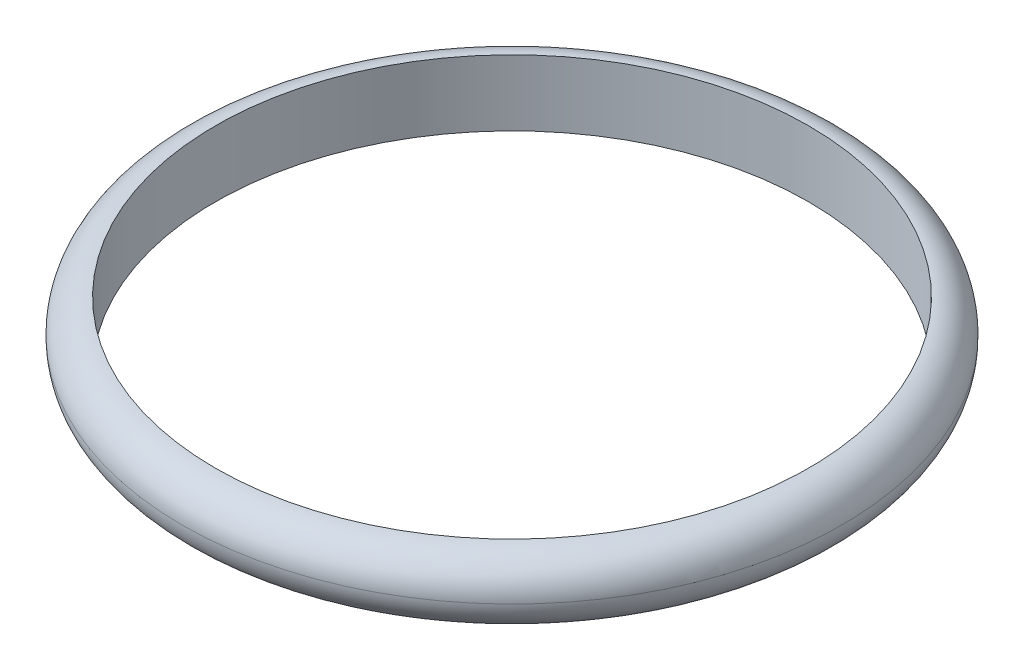
ISO-10303-21;
HEADER;
FILE_DESCRIPTION(('STEP AP214'),'2;1');
FILE_NAME('part.step','',(''),(''),'','','');
FILE_SCHEMA(('AUTOMOTIVE_DESIGN { 1 0 10303 214 1 1 1 1 }'));
ENDSEC;
DATA;
#1=APPLICATION_CONTEXT('core data for automotive mechanical design processes');
#2=APPLICATION_PROTOCOL_DEFINITION('international standard','automotive_design',2000,#1);
#3=PRODUCT_CONTEXT('',#1,'mechanical');
#4=PRODUCT('Part','Part','',(#3));
#5=PRODUCT_RELATED_PRODUCT_CATEGORY('part','',(#4));
#6=PRODUCT_DEFINITION_FORMATION('','',#4);
#7=PRODUCT_DEFINITION_CONTEXT('part definition',#1,'design');
#8=PRODUCT_DEFINITION('design','',#6,#7);
#9=PRODUCT_DEFINITION_SHAPE('','',#8);
#10=(LENGTH_UNIT() NAMED_UNIT(*) SI_UNIT(.MILLI.,.METRE.));
#11=(NAMED_UNIT(*) PLANE_ANGLE_UNIT() SI_UNIT($,.RADIAN.));
#12=(NAMED_UNIT(*) SI_UNIT($,.STERADIAN.) SOLID_ANGLE_UNIT());
#13=UNCERTAINTY_MEASURE_WITH_UNIT(LENGTH_MEASURE(1.E-05),#10,'distance_accuracy_value','');
#14=(GEOMETRIC_REPRESENTATION_CONTEXT(3) GLOBAL_UNCERTAINTY_ASSIGNED_CONTEXT((#13)) GLOBAL_UNIT_ASSIGNED_CONTEXT((#10,
#11,#12)) REPRESENTATION_CONTEXT('',''));
#15=CARTESIAN_POINT('',(0.,0.,0.));
#16=DIRECTION('',(0.,0.,1.));
#17=DIRECTION('',(1.,0.,0.));
#18=AXIS2_PLACEMENT_3D('',#15,#16,#17);
#19=CARTESIAN_POINT('',(0.,4.,0.));
#20=DIRECTION('',(0.,-1.,0.));
#21=DIRECTION('',(0.,0.,-1.));
#22=AXIS2_PLACEMENT_3D('',#19,#20,#21);
#23=CYLINDRICAL_SURFACE('',#22,18.);
#24=CARTESIAN_POINT('',(0.,4.,0.));
#25=DIRECTION('',(0.,1.,0.));
#26=DIRECTION('',(0.,0.,1.));
#27=AXIS2_PLACEMENT_3D('',#24,#25,#26);
#28=CIRCLE('',#27,18.);
#29=CARTESIAN_POINT('',(0.,4.,18.));
#30=VERTEX_POINT('',#29);
#31=EDGE_CURVE('E10',#30,#30,#28,.T.);
#32=ORIENTED_EDGE('',*,*,#31,.T.);
#33=EDGE_LOOP('',(#32));
#34=FACE_BOUND('',#33,.T.);
#35=CARTESIAN_POINT('',(0.,0.,0.));
#36=DIRECTION('',(0.,1.,0.));
#37=DIRECTION('',(0.,0.,1.));
#38=AXIS2_PLACEMENT_3D('',#35,#36,#37);
#39=CIRCLE('',#38,18.);
#40=CARTESIAN_POINT('',(0.,0.,18.));
#41=VERTEX_POINT('',#40);
#42=EDGE_CURVE('E37',#41,#41,#39,.T.);
#43=ORIENTED_EDGE('',*,*,#42,.F.);
#44=EDGE_LOOP('',(#43));
#45=FACE_BOUND('',#44,.T.);
#46=ADVANCED_FACE('F29',(#34,#45),#23,.F.);
#47=CARTESIAN_POINT('',(0.,2.,0.));
#48=DIRECTION('',(0.,1.,0.));
#49=DIRECTION('',(0.,0.,1.));
#50=AXIS2_PLACEMENT_3D('',#47,#48,#49);
#51=TOROIDAL_SURFACE('',#50,18.,2.);
#52=ORIENTED_EDGE('',*,*,#31,.F.);
#53=EDGE_LOOP('',(#52));
#54=FACE_BOUND('',#53,.T.);
#55=CARTESIAN_POINT('',(0.,2.,0.));
#56=DIRECTION('',(0.,1.,0.));
#57=DIRECTION('',(0.,0.,1.));
#58=AXIS2_PLACEMENT_3D('',#55,#56,#57);
#59=CIRCLE('',#58,20.);
#60=CARTESIAN_POINT('',(0.,2.,20.));
#61=VERTEX_POINT('',#60);
#62=EDGE_CURVE('E33',#61,#61,#59,.F.);
#63=ORIENTED_EDGE('',*,*,#62,.F.);
#64=EDGE_LOOP('',(#63));
#65=FACE_BOUND('',#64,.T.);
#66=ADVANCED_FACE('F31',(#54,#65),#51,.T.);
#67=CARTESIAN_POINT('',(0.,2.,0.));
#68=DIRECTION('',(0.,1.,0.));
#69=DIRECTION('',(0.,0.,1.));
#70=AXIS2_PLACEMENT_3D('',#67,#68,#69);
#71=TOROIDAL_SURFACE('',#70,18.,2.);
#72=ORIENTED_EDGE('',*,*,#42,.T.);
#73=EDGE_LOOP('',(#72));
#74=FACE_BOUND('',#73,.T.);
#75=ORIENTED_EDGE('',*,*,#62,.T.);
#76=EDGE_LOOP('',(#75));
#77=FACE_BOUND('',#76,.T.);
#78=ADVANCED_FACE('F47',(#74,#77),#71,.T.);
#79=CLOSED_SHELL('',(#46,#66,#78));
#80=MANIFOLD_SOLID_BREP('B2',#79);
#81=ADVANCED_BREP_SHAPE_REPRESENTATION('',(#18,#80),#14);
#82=SHAPE_DEFINITION_REPRESENTATION(#9,#81);
ENDSEC;
END-ISO-10303-21;
